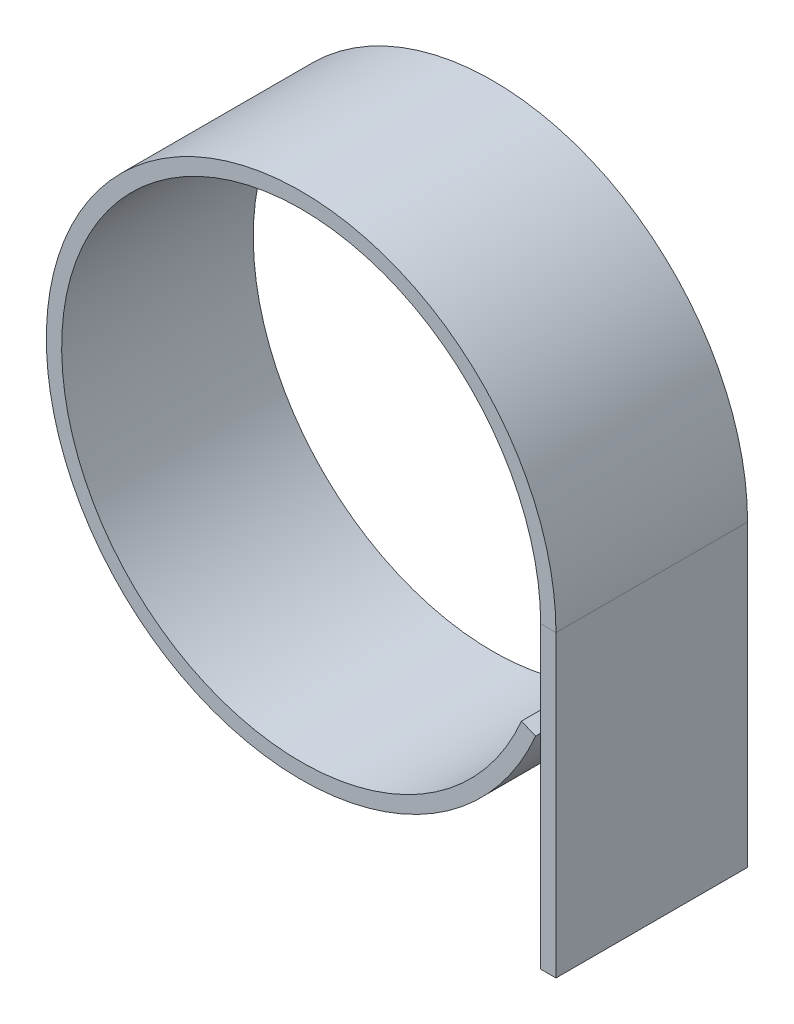
ISO-10303-21;
HEADER;
FILE_DESCRIPTION(('STEP AP214'),'2;1');
FILE_NAME('part.step','',(''),(''),'','','');
FILE_SCHEMA(('AUTOMOTIVE_DESIGN { 1 0 10303 214 1 1 1 1 }'));
ENDSEC;
DATA;
#1=APPLICATION_CONTEXT('core data for automotive mechanical design processes');
#2=APPLICATION_PROTOCOL_DEFINITION('international standard','automotive_design',2000,#1);
#3=PRODUCT_CONTEXT('',#1,'mechanical');
#4=PRODUCT('Part','Part','',(#3));
#5=PRODUCT_RELATED_PRODUCT_CATEGORY('part','',(#4));
#6=PRODUCT_DEFINITION_FORMATION('','',#4);
#7=PRODUCT_DEFINITION_CONTEXT('part definition',#1,'design');
#8=PRODUCT_DEFINITION('design','',#6,#7);
#9=PRODUCT_DEFINITION_SHAPE('','',#8);
#10=(LENGTH_UNIT() NAMED_UNIT(*) SI_UNIT(.MILLI.,.METRE.));
#11=(NAMED_UNIT(*) PLANE_ANGLE_UNIT() SI_UNIT($,.RADIAN.));
#12=(NAMED_UNIT(*) SI_UNIT($,.STERADIAN.) SOLID_ANGLE_UNIT());
#13=UNCERTAINTY_MEASURE_WITH_UNIT(LENGTH_MEASURE(1.E-05),#10,'distance_accuracy_value','');
#14=(GEOMETRIC_REPRESENTATION_CONTEXT(3) GLOBAL_UNCERTAINTY_ASSIGNED_CONTEXT((#13)) GLOBAL_UNIT_ASSIGNED_CONTEXT((#10,
#11,#12)) REPRESENTATION_CONTEXT('',''));
#15=CARTESIAN_POINT('',(0.,0.,0.));
#16=DIRECTION('',(0.,0.,1.));
#17=DIRECTION('',(1.,0.,0.));
#18=AXIS2_PLACEMENT_3D('',#15,#16,#17);
#19=CARTESIAN_POINT('',(0.8,15.612494995996,10.));
#20=DIRECTION('',(0.,0.,1.));
#21=DIRECTION('',(1.,0.,0.));
#22=AXIS2_PLACEMENT_3D('',#19,#20,#21);
#23=PLANE('',#22);
#24=DIRECTION('',(-1.,0.,0.));
#25=VECTOR('',#24,1.);
#26=CARTESIAN_POINT('',(0.8,15.612494995996,10.));
#27=LINE('',#26,#25);
#28=CARTESIAN_POINT('',(0.8,15.612494995996,10.));
#29=VERTEX_POINT('',#28);
#30=CARTESIAN_POINT('',(0.,15.612494995996,10.));
#31=VERTEX_POINT('',#30);
#32=EDGE_CURVE('E11',#29,#31,#27,.T.);
#33=ORIENTED_EDGE('',*,*,#32,.F.);
#34=CARTESIAN_POINT('',(-12.5,15.612494995996,10.));
#35=DIRECTION('',(0.,0.,1.));
#36=DIRECTION('',(1.,0.,0.));
#37=AXIS2_PLACEMENT_3D('',#34,#35,#36);
#38=CIRCLE('',#37,13.3);
#39=CARTESIAN_POINT('',(-0.264000000000002,10.3999808233534,10.));
#40=VERTEX_POINT('',#39);
#41=EDGE_CURVE('E82',#29,#40,#38,.T.);
#42=ORIENTED_EDGE('',*,*,#41,.T.);
#43=DIRECTION('',(0.92,-0.391918358845309,0.));
#44=VECTOR('',#43,1.);
#45=CARTESIAN_POINT('',(-1.,10.7135155104296,10.));
#46=LINE('',#45,#44);
#47=CARTESIAN_POINT('',(-1.,10.7135155104296,10.));
#48=VERTEX_POINT('',#47);
#49=EDGE_CURVE('E143',#48,#40,#46,.T.);
#50=ORIENTED_EDGE('',*,*,#49,.F.);
#51=CARTESIAN_POINT('',(-12.5,15.612494995996,10.));
#52=DIRECTION('',(0.,0.,1.));
#53=DIRECTION('',(1.,0.,0.));
#54=AXIS2_PLACEMENT_3D('',#51,#52,#53);
#55=CIRCLE('',#54,12.5);
#56=EDGE_CURVE('E109',#31,#48,#55,.T.);
#57=ORIENTED_EDGE('',*,*,#56,.F.);
#58=EDGE_LOOP('',(#33,#42,#50,#57));
#59=FACE_BOUND('',#58,.T.);
#60=ADVANCED_FACE('F35',(#59),#23,.T.);
#61=CARTESIAN_POINT('',(0.,15.612494995996,0.));
#62=DIRECTION('',(0.,0.,-1.));
#63=DIRECTION('',(-1.,0.,0.));
#64=AXIS2_PLACEMENT_3D('',#61,#62,#63);
#65=PLANE('',#64);
#66=DIRECTION('',(1.,0.,0.));
#67=VECTOR('',#66,1.);
#68=CARTESIAN_POINT('',(0.,15.612494995996,0.));
#69=LINE('',#68,#67);
#70=CARTESIAN_POINT('',(0.,15.612494995996,0.));
#71=VERTEX_POINT('',#70);
#72=CARTESIAN_POINT('',(0.8,15.612494995996,0.));
#73=VERTEX_POINT('',#72);
#74=EDGE_CURVE('E43',#71,#73,#69,.T.);
#75=ORIENTED_EDGE('',*,*,#74,.F.);
#76=CARTESIAN_POINT('',(-12.5,15.612494995996,0.));
#77=DIRECTION('',(0.,0.,1.));
#78=DIRECTION('',(1.,0.,0.));
#79=AXIS2_PLACEMENT_3D('',#76,#77,#78);
#80=CIRCLE('',#79,12.5);
#81=CARTESIAN_POINT('',(-1.,10.7135155104296,0.));
#82=VERTEX_POINT('',#81);
#83=EDGE_CURVE('E124',#71,#82,#80,.T.);
#84=ORIENTED_EDGE('',*,*,#83,.T.);
#85=DIRECTION('',(0.92,-0.391918358845309,0.));
#86=VECTOR('',#85,1.);
#87=CARTESIAN_POINT('',(-1.,10.7135155104296,0.));
#88=LINE('',#87,#86);
#89=CARTESIAN_POINT('',(-0.264000000000002,10.3999808233534,0.));
#90=VERTEX_POINT('',#89);
#91=EDGE_CURVE('E121',#82,#90,#88,.T.);
#92=ORIENTED_EDGE('',*,*,#91,.T.);
#93=CARTESIAN_POINT('',(-12.5,15.612494995996,0.));
#94=DIRECTION('',(0.,0.,1.));
#95=DIRECTION('',(1.,0.,0.));
#96=AXIS2_PLACEMENT_3D('',#93,#94,#95);
#97=CIRCLE('',#96,13.3);
#98=EDGE_CURVE('E118',#73,#90,#97,.T.);
#99=ORIENTED_EDGE('',*,*,#98,.F.);
#100=EDGE_LOOP('',(#75,#84,#92,#99));
#101=FACE_BOUND('',#100,.T.);
#102=ADVANCED_FACE('F149',(#101),#65,.T.);
#103=CARTESIAN_POINT('',(-12.5,15.612494995996,10.));
#104=DIRECTION('',(0.,0.,-1.));
#105=DIRECTION('',(-1.,0.,0.));
#106=AXIS2_PLACEMENT_3D('',#103,#104,#105);
#107=CYLINDRICAL_SURFACE('',#106,13.3);
#108=ORIENTED_EDGE('',*,*,#98,.T.);
#109=DIRECTION('',(0.,0.,-1.));
#110=VECTOR('',#109,1.);
#111=CARTESIAN_POINT('',(-0.264000000000002,10.3999808233534,10.));
#112=LINE('',#111,#110);
#113=EDGE_CURVE('E138',#40,#90,#112,.T.);
#114=ORIENTED_EDGE('',*,*,#113,.F.);
#115=ORIENTED_EDGE('',*,*,#41,.F.);
#116=DIRECTION('',(0.,0.,-1.));
#117=VECTOR('',#116,1.);
#118=CARTESIAN_POINT('',(0.8,15.612494995996,10.));
#119=LINE('',#118,#117);
#120=EDGE_CURVE('E114',#29,#73,#119,.T.);
#121=ORIENTED_EDGE('',*,*,#120,.T.);
#122=EDGE_LOOP('',(#108,#114,#115,#121));
#123=FACE_BOUND('',#122,.T.);
#124=ADVANCED_FACE('F146',(#123),#107,.T.);
#125=CARTESIAN_POINT('',(-1.,10.7135155104296,10.));
#126=DIRECTION('',(0.391918358845309,0.92,0.));
#127=DIRECTION('',(-0.92,0.391918358845309,0.));
#128=AXIS2_PLACEMENT_3D('',#125,#126,#127);
#129=PLANE('',#128);
#130=ORIENTED_EDGE('',*,*,#91,.F.);
#131=DIRECTION('',(0.,0.,-1.));
#132=VECTOR('',#131,1.);
#133=CARTESIAN_POINT('',(-1.,10.7135155104296,10.));
#134=LINE('',#133,#132);
#135=EDGE_CURVE('E136',#48,#82,#134,.T.);
#136=ORIENTED_EDGE('',*,*,#135,.F.);
#137=ORIENTED_EDGE('',*,*,#49,.T.);
#138=ORIENTED_EDGE('',*,*,#113,.T.);
#139=EDGE_LOOP('',(#130,#136,#137,#138));
#140=FACE_BOUND('',#139,.T.);
#141=ADVANCED_FACE('F142',(#140),#129,.T.);
#142=CARTESIAN_POINT('',(-12.5,15.612494995996,10.));
#143=DIRECTION('',(0.,0.,-1.));
#144=DIRECTION('',(-1.,0.,0.));
#145=AXIS2_PLACEMENT_3D('',#142,#143,#144);
#146=CYLINDRICAL_SURFACE('',#145,12.5);
#147=ORIENTED_EDGE('',*,*,#83,.F.);
#148=DIRECTION('',(0.,0.,-1.));
#149=VECTOR('',#148,1.);
#150=CARTESIAN_POINT('',(0.,15.612494995996,10.));
#151=LINE('',#150,#149);
#152=EDGE_CURVE('E102',#31,#71,#151,.T.);
#153=ORIENTED_EDGE('',*,*,#152,.F.);
#154=ORIENTED_EDGE('',*,*,#56,.T.);
#155=ORIENTED_EDGE('',*,*,#135,.T.);
#156=EDGE_LOOP('',(#147,#153,#154,#155));
#157=FACE_BOUND('',#156,.T.);
#158=ADVANCED_FACE('F152',(#157),#146,.F.);
#159=CARTESIAN_POINT('',(0.,0.,10.));
#160=DIRECTION('',(-1.,0.,0.));
#161=DIRECTION('',(0.,0.,1.));
#162=AXIS2_PLACEMENT_3D('',#159,#160,#161);
#163=PLANE('',#162);
#164=DIRECTION('',(0.,1.,0.));
#165=VECTOR('',#164,1.);
#166=CARTESIAN_POINT('',(0.,0.,0.));
#167=LINE('',#166,#165);
#168=CARTESIAN_POINT('',(0.,0.,0.));
#169=VERTEX_POINT('',#168);
#170=EDGE_CURVE('E97',#169,#71,#167,.T.);
#171=ORIENTED_EDGE('',*,*,#170,.F.);
#172=DIRECTION('',(0.,0.,-1.));
#173=VECTOR('',#172,1.);
#174=CARTESIAN_POINT('',(0.,0.,10.));
#175=LINE('',#174,#173);
#176=CARTESIAN_POINT('',(0.,0.,10.));
#177=VERTEX_POINT('',#176);
#178=EDGE_CURVE('E92',#177,#169,#175,.T.);
#179=ORIENTED_EDGE('',*,*,#178,.F.);
#180=DIRECTION('',(0.,1.,0.));
#181=VECTOR('',#180,1.);
#182=CARTESIAN_POINT('',(0.,0.,10.));
#183=LINE('',#182,#181);
#184=EDGE_CURVE('E96',#177,#31,#183,.T.);
#185=ORIENTED_EDGE('',*,*,#184,.T.);
#186=ORIENTED_EDGE('',*,*,#152,.T.);
#187=EDGE_LOOP('',(#171,#179,#185,#186));
#188=FACE_BOUND('',#187,.T.);
#189=ADVANCED_FACE('F94',(#188),#163,.T.);
#190=CARTESIAN_POINT('',(0.8,0.,10.));
#191=DIRECTION('',(0.,-1.,0.));
#192=DIRECTION('',(0.,0.,-1.));
#193=AXIS2_PLACEMENT_3D('',#190,#191,#192);
#194=PLANE('',#193);
#195=DIRECTION('',(-1.,0.,0.));
#196=VECTOR('',#195,1.);
#197=CARTESIAN_POINT('',(0.8,0.,0.));
#198=LINE('',#197,#196);
#199=CARTESIAN_POINT('',(0.8,0.,0.));
#200=VERTEX_POINT('',#199);
#201=EDGE_CURVE('E128',#200,#169,#198,.T.);
#202=ORIENTED_EDGE('',*,*,#201,.F.);
#203=DIRECTION('',(0.,0.,-1.));
#204=VECTOR('',#203,1.);
#205=CARTESIAN_POINT('',(0.8,0.,10.));
#206=LINE('',#205,#204);
#207=CARTESIAN_POINT('',(0.8,0.,10.));
#208=VERTEX_POINT('',#207);
#209=EDGE_CURVE('E72',#208,#200,#206,.T.);
#210=ORIENTED_EDGE('',*,*,#209,.F.);
#211=DIRECTION('',(-1.,0.,0.));
#212=VECTOR('',#211,1.);
#213=CARTESIAN_POINT('',(0.8,0.,10.));
#214=LINE('',#213,#212);
#215=EDGE_CURVE('E107',#208,#177,#214,.T.);
#216=ORIENTED_EDGE('',*,*,#215,.T.);
#217=ORIENTED_EDGE('',*,*,#178,.T.);
#218=EDGE_LOOP('',(#202,#210,#216,#217));
#219=FACE_BOUND('',#218,.T.);
#220=ADVANCED_FACE('F111',(#219),#194,.T.);
#221=CARTESIAN_POINT('',(0.8,0.,10.));
#222=DIRECTION('',(-1.,0.,0.));
#223=DIRECTION('',(0.,0.,1.));
#224=AXIS2_PLACEMENT_3D('',#221,#222,#223);
#225=PLANE('',#224);
#226=DIRECTION('',(0.,1.,0.));
#227=VECTOR('',#226,1.);
#228=CARTESIAN_POINT('',(0.8,0.,0.));
#229=LINE('',#228,#227);
#230=EDGE_CURVE('E130',#200,#73,#229,.T.);
#231=ORIENTED_EDGE('',*,*,#230,.T.);
#232=ORIENTED_EDGE('',*,*,#120,.F.);
#233=DIRECTION('',(0.,1.,0.));
#234=VECTOR('',#233,1.);
#235=CARTESIAN_POINT('',(0.8,0.,10.));
#236=LINE('',#235,#234);
#237=EDGE_CURVE('E112',#208,#29,#236,.T.);
#238=ORIENTED_EDGE('',*,*,#237,.F.);
#239=ORIENTED_EDGE('',*,*,#209,.T.);
#240=EDGE_LOOP('',(#231,#232,#238,#239));
#241=FACE_BOUND('',#240,.T.);
#242=ADVANCED_FACE('F155',(#241),#225,.F.);
#243=CARTESIAN_POINT('',(-12.5,15.612494995996,10.));
#244=DIRECTION('',(0.,0.,1.));
#245=DIRECTION('',(1.,0.,0.));
#246=AXIS2_PLACEMENT_3D('',#243,#244,#245);
#247=PLANE('',#246);
#248=ORIENTED_EDGE('',*,*,#237,.T.);
#249=ORIENTED_EDGE('',*,*,#32,.T.);
#250=ORIENTED_EDGE('',*,*,#184,.F.);
#251=ORIENTED_EDGE('',*,*,#215,.F.);
#252=EDGE_LOOP('',(#248,#249,#250,#251));
#253=FACE_BOUND('',#252,.T.);
#254=ADVANCED_FACE('F106',(#253),#247,.T.);
#255=CARTESIAN_POINT('',(-12.5,15.612494995996,0.));
#256=DIRECTION('',(0.,0.,1.));
#257=DIRECTION('',(1.,0.,0.));
#258=AXIS2_PLACEMENT_3D('',#255,#256,#257);
#259=PLANE('',#258);
#260=ORIENTED_EDGE('',*,*,#170,.T.);
#261=ORIENTED_EDGE('',*,*,#74,.T.);
#262=ORIENTED_EDGE('',*,*,#230,.F.);
#263=ORIENTED_EDGE('',*,*,#201,.T.);
#264=EDGE_LOOP('',(#260,#261,#262,#263));
#265=FACE_BOUND('',#264,.T.);
#266=ADVANCED_FACE('F154',(#265),#259,.F.);
#267=CLOSED_SHELL('',(#60,#102,#124,#141,#158,#189,#220,#242,#254,#266));
#268=MANIFOLD_SOLID_BREP('B2',#267);
#269=ADVANCED_BREP_SHAPE_REPRESENTATION('',(#18,#268),#14);
#270=SHAPE_DEFINITION_REPRESENTATION(#9,#269);
ENDSEC;
END-ISO-10303-21;
